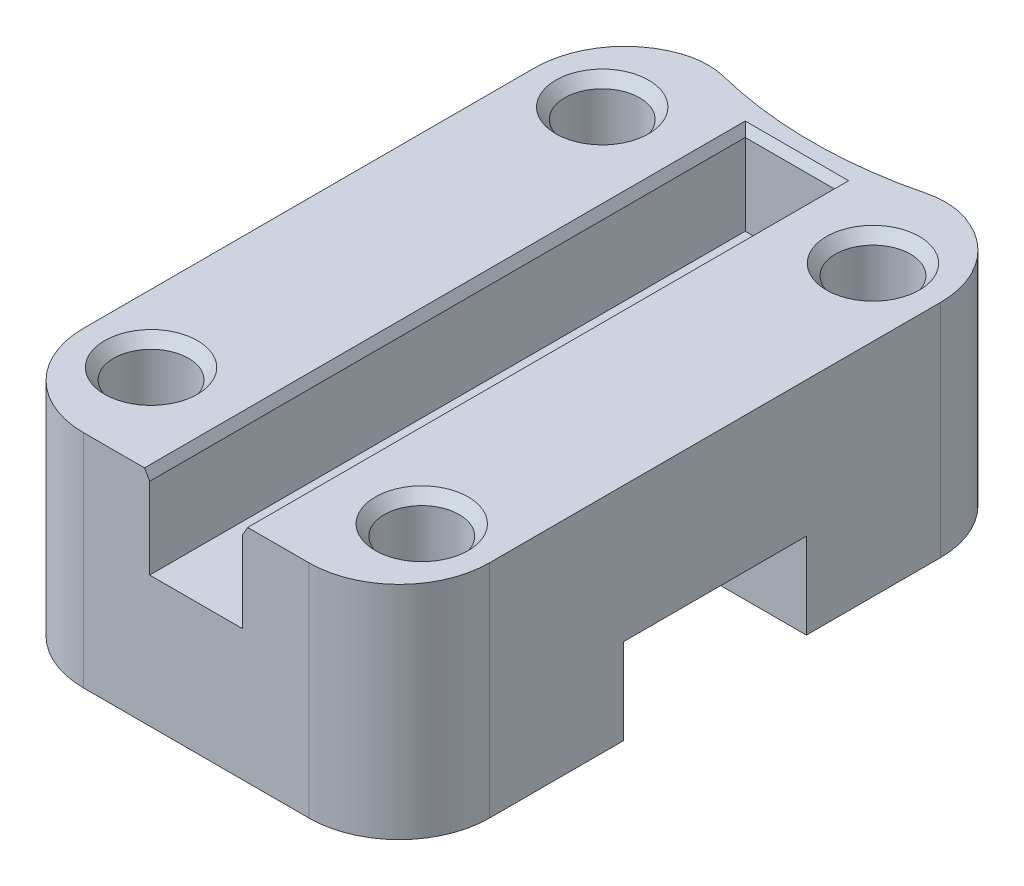
ISO-10303-21;
HEADER;
FILE_DESCRIPTION(('STEP AP214'),'2;1');
FILE_NAME('part.step','',(''),(''),'','','');
FILE_SCHEMA(('AUTOMOTIVE_DESIGN { 1 0 10303 214 1 1 1 1 }'));
ENDSEC;
DATA;
#1=APPLICATION_CONTEXT('core data for automotive mechanical design processes');
#2=APPLICATION_PROTOCOL_DEFINITION('international standard','automotive_design',2000,#1);
#3=PRODUCT_CONTEXT('',#1,'mechanical');
#4=PRODUCT('Part','Part','',(#3));
#5=PRODUCT_RELATED_PRODUCT_CATEGORY('part','',(#4));
#6=PRODUCT_DEFINITION_FORMATION('','',#4);
#7=PRODUCT_DEFINITION_CONTEXT('part definition',#1,'design');
#8=PRODUCT_DEFINITION('design','',#6,#7);
#9=PRODUCT_DEFINITION_SHAPE('','',#8);
#10=(LENGTH_UNIT() NAMED_UNIT(*) SI_UNIT(.MILLI.,.METRE.));
#11=(NAMED_UNIT(*) PLANE_ANGLE_UNIT() SI_UNIT($,.RADIAN.));
#12=(NAMED_UNIT(*) SI_UNIT($,.STERADIAN.) SOLID_ANGLE_UNIT());
#13=UNCERTAINTY_MEASURE_WITH_UNIT(LENGTH_MEASURE(1.E-05),#10,'distance_accuracy_value','');
#14=(GEOMETRIC_REPRESENTATION_CONTEXT(3) GLOBAL_UNCERTAINTY_ASSIGNED_CONTEXT((#13)) GLOBAL_UNIT_ASSIGNED_CONTEXT((#10,
#11,#12)) REPRESENTATION_CONTEXT('',''));
#15=CARTESIAN_POINT('',(0.,0.,0.));
#16=DIRECTION('',(0.,0.,1.));
#17=DIRECTION('',(1.,0.,0.));
#18=AXIS2_PLACEMENT_3D('',#15,#16,#17);
#19=CARTESIAN_POINT('',(0.,0.,0.));
#20=DIRECTION('',(0.,1.,0.));
#21=DIRECTION('',(0.,0.,1.));
#22=AXIS2_PLACEMENT_3D('',#19,#20,#21);
#23=PLANE('',#22);
#24=CARTESIAN_POINT('',(-15.,0.,25.));
#25=DIRECTION('',(0.,-1.,0.));
#26=DIRECTION('',(0.,0.,-1.));
#27=AXIS2_PLACEMENT_3D('',#24,#25,#26);
#28=CIRCLE('',#27,4.15);
#29=CARTESIAN_POINT('',(-15.,0.,20.85));
#30=VERTEX_POINT('',#29);
#31=EDGE_CURVE('E225',#30,#30,#28,.T.);
#32=ORIENTED_EDGE('',*,*,#31,.F.);
#33=EDGE_LOOP('',(#32));
#34=FACE_BOUND('',#33,.T.);
#35=CARTESIAN_POINT('',(15.,0.,25.));
#36=DIRECTION('',(0.,-1.,0.));
#37=DIRECTION('',(0.,0.,-1.));
#38=AXIS2_PLACEMENT_3D('',#35,#36,#37);
#39=CIRCLE('',#38,4.15);
#40=CARTESIAN_POINT('',(15.,0.,20.85));
#41=VERTEX_POINT('',#40);
#42=EDGE_CURVE('E229',#41,#41,#39,.T.);
#43=ORIENTED_EDGE('',*,*,#42,.F.);
#44=EDGE_LOOP('',(#43));
#45=FACE_BOUND('',#44,.T.);
#46=DIRECTION('',(1.,0.,0.));
#47=VECTOR('',#46,1.);
#48=CARTESIAN_POINT('',(22.5,0.,35.));
#49=LINE('',#48,#47);
#50=CARTESIAN_POINT('',(-12.5,0.,35.));
#51=VERTEX_POINT('',#50);
#52=CARTESIAN_POINT('',(12.5,0.,35.));
#53=VERTEX_POINT('',#52);
#54=EDGE_CURVE('E269',#51,#53,#49,.T.);
#55=ORIENTED_EDGE('',*,*,#54,.F.);
#56=CARTESIAN_POINT('',(-12.5,0.,25.));
#57=DIRECTION('',(0.,1.,0.));
#58=DIRECTION('',(0.,0.,1.));
#59=AXIS2_PLACEMENT_3D('',#56,#57,#58);
#60=CIRCLE('',#59,10.);
#61=CARTESIAN_POINT('',(-22.5,0.,25.));
#62=VERTEX_POINT('',#61);
#63=EDGE_CURVE('E328',#51,#62,#60,.F.);
#64=ORIENTED_EDGE('',*,*,#63,.T.);
#65=DIRECTION('',(0.,0.,1.));
#66=VECTOR('',#65,1.);
#67=CARTESIAN_POINT('',(-22.5,0.,35.));
#68=LINE('',#67,#66);
#69=CARTESIAN_POINT('',(-22.5,0.,10.125));
#70=VERTEX_POINT('',#69);
#71=EDGE_CURVE('E262',#70,#62,#68,.T.);
#72=ORIENTED_EDGE('',*,*,#71,.F.);
#73=DIRECTION('',(1.,0.,0.));
#74=VECTOR('',#73,1.);
#75=CARTESIAN_POINT('',(-22.5,0.,10.125));
#76=LINE('',#75,#74);
#77=CARTESIAN_POINT('',(22.5,0.,10.125));
#78=VERTEX_POINT('',#77);
#79=EDGE_CURVE('E245',#70,#78,#76,.T.);
#80=ORIENTED_EDGE('',*,*,#79,.T.);
#81=DIRECTION('',(0.,0.,-1.));
#82=VECTOR('',#81,1.);
#83=CARTESIAN_POINT('',(22.5,0.,35.));
#84=LINE('',#83,#82);
#85=CARTESIAN_POINT('',(22.5,0.,25.));
#86=VERTEX_POINT('',#85);
#87=EDGE_CURVE('E266',#86,#78,#84,.T.);
#88=ORIENTED_EDGE('',*,*,#87,.F.);
#89=CARTESIAN_POINT('',(12.5,0.,25.));
#90=DIRECTION('',(0.,1.,0.));
#91=DIRECTION('',(0.,0.,1.));
#92=AXIS2_PLACEMENT_3D('',#89,#90,#91);
#93=CIRCLE('',#92,10.);
#94=EDGE_CURVE('E326',#86,#53,#93,.F.);
#95=ORIENTED_EDGE('',*,*,#94,.T.);
#96=EDGE_LOOP('',(#55,#64,#72,#80,#88,#95));
#97=FACE_BOUND('',#96,.T.);
#98=ADVANCED_FACE('F35',(#34,#45,#97),#23,.F.);
#99=CARTESIAN_POINT('',(-22.5,14.5,35.));
#100=DIRECTION('',(1.,0.,0.));
#101=DIRECTION('',(0.,0.,-1.));
#102=AXIS2_PLACEMENT_3D('',#99,#100,#101);
#103=PLANE('',#102);
#104=ORIENTED_EDGE('',*,*,#71,.T.);
#105=DIRECTION('',(0.,-1.,0.));
#106=VECTOR('',#105,1.);
#107=CARTESIAN_POINT('',(-22.5,14.5,25.));
#108=LINE('',#107,#106);
#109=CARTESIAN_POINT('',(-22.5,24.5,25.));
#110=VERTEX_POINT('',#109);
#111=EDGE_CURVE('E333',#62,#110,#108,.F.);
#112=ORIENTED_EDGE('',*,*,#111,.T.);
#113=DIRECTION('',(0.,0.,1.));
#114=VECTOR('',#113,1.);
#115=CARTESIAN_POINT('',(-22.5,24.5,35.));
#116=LINE('',#115,#114);
#117=CARTESIAN_POINT('',(-22.5,24.5,-25.));
#118=VERTEX_POINT('',#117);
#119=EDGE_CURVE('E217',#118,#110,#116,.T.);
#120=ORIENTED_EDGE('',*,*,#119,.F.);
#121=DIRECTION('',(0.,-1.,0.));
#122=VECTOR('',#121,1.);
#123=CARTESIAN_POINT('',(-22.5,14.5,-25.));
#124=LINE('',#123,#122);
#125=CARTESIAN_POINT('',(-22.5,0.,-25.));
#126=VERTEX_POINT('',#125);
#127=EDGE_CURVE('E330',#118,#126,#124,.T.);
#128=ORIENTED_EDGE('',*,*,#127,.T.);
#129=CARTESIAN_POINT('',(-22.5,0.,-10.125));
#130=VERTEX_POINT('',#129);
#131=EDGE_CURVE('E267',#126,#130,#68,.T.);
#132=ORIENTED_EDGE('',*,*,#131,.T.);
#133=DIRECTION('',(0.,1.,0.));
#134=VECTOR('',#133,1.);
#135=CARTESIAN_POINT('',(-22.5,9.50000000000001,-10.125));
#136=LINE('',#135,#134);
#137=CARTESIAN_POINT('',(-22.5,9.50000000000001,-10.125));
#138=VERTEX_POINT('',#137);
#139=EDGE_CURVE('E239',#130,#138,#136,.T.);
#140=ORIENTED_EDGE('',*,*,#139,.T.);
#141=DIRECTION('',(0.,0.,1.));
#142=VECTOR('',#141,1.);
#143=CARTESIAN_POINT('',(-22.5,9.50000000000001,-10.125));
#144=LINE('',#143,#142);
#145=CARTESIAN_POINT('',(-22.5,9.5,10.125));
#146=VERTEX_POINT('',#145);
#147=EDGE_CURVE('E242',#138,#146,#144,.T.);
#148=ORIENTED_EDGE('',*,*,#147,.T.);
#149=DIRECTION('',(0.,-1.,0.));
#150=VECTOR('',#149,1.);
#151=CARTESIAN_POINT('',(-22.5,9.5,10.125));
#152=LINE('',#151,#150);
#153=EDGE_CURVE('E236',#146,#70,#152,.T.);
#154=ORIENTED_EDGE('',*,*,#153,.T.);
#155=EDGE_LOOP('',(#104,#112,#120,#128,#132,#140,#148,#154));
#156=FACE_BOUND('',#155,.T.);
#157=ADVANCED_FACE('F387',(#156),#103,.F.);
#158=CARTESIAN_POINT('',(22.5,14.5,35.));
#159=DIRECTION('',(0.,0.,-1.));
#160=DIRECTION('',(-1.,0.,0.));
#161=AXIS2_PLACEMENT_3D('',#158,#159,#160);
#162=PLANE('',#161);
#163=DIRECTION('',(1.,0.,0.));
#164=VECTOR('',#163,1.);
#165=CARTESIAN_POINT('',(-5.15,24.5,35.));
#166=LINE('',#165,#164);
#167=CARTESIAN_POINT('',(-12.5,24.5,35.));
#168=VERTEX_POINT('',#167);
#169=CARTESIAN_POINT('',(-5.72735026918963,24.5,35.));
#170=VERTEX_POINT('',#169);
#171=EDGE_CURVE('E418',#168,#170,#166,.T.);
#172=ORIENTED_EDGE('',*,*,#171,.F.);
#173=DIRECTION('',(0.,-1.,0.));
#174=VECTOR('',#173,1.);
#175=CARTESIAN_POINT('',(-12.5,14.5,35.));
#176=LINE('',#175,#174);
#177=EDGE_CURVE('E323',#168,#51,#176,.T.);
#178=ORIENTED_EDGE('',*,*,#177,.T.);
#179=ORIENTED_EDGE('',*,*,#54,.T.);
#180=DIRECTION('',(0.,-1.,0.));
#181=VECTOR('',#180,1.);
#182=CARTESIAN_POINT('',(12.5,14.5,35.));
#183=LINE('',#182,#181);
#184=CARTESIAN_POINT('',(12.5,24.5,35.));
#185=VERTEX_POINT('',#184);
#186=EDGE_CURVE('E319',#53,#185,#183,.F.);
#187=ORIENTED_EDGE('',*,*,#186,.T.);
#188=DIRECTION('',(1.,0.,0.));
#189=VECTOR('',#188,1.);
#190=CARTESIAN_POINT('',(5.15,24.5,35.));
#191=LINE('',#190,#189);
#192=CARTESIAN_POINT('',(5.70756444527081,24.5,35.));
#193=VERTEX_POINT('',#192);
#194=EDGE_CURVE('E421',#193,#185,#191,.T.);
#195=ORIENTED_EDGE('',*,*,#194,.F.);
#196=DIRECTION('',(-0.500000016850885,-0.866025394055576,0.));
#197=VECTOR('',#196,1.);
#198=CARTESIAN_POINT('',(5.71018744100996,24.5045431616841,35.));
#199=LINE('',#198,#197);
#200=CARTESIAN_POINT('',(5.15,23.5342700956927,35.));
#201=VERTEX_POINT('',#200);
#202=EDGE_CURVE('E309',#193,#201,#199,.T.);
#203=ORIENTED_EDGE('',*,*,#202,.T.);
#204=DIRECTION('',(0.,-1.,0.));
#205=VECTOR('',#204,1.);
#206=CARTESIAN_POINT('',(5.15,24.5,35.));
#207=LINE('',#206,#205);
#208=CARTESIAN_POINT('',(5.15,14.5,35.));
#209=VERTEX_POINT('',#208);
#210=EDGE_CURVE('E218',#201,#209,#207,.T.);
#211=ORIENTED_EDGE('',*,*,#210,.T.);
#212=DIRECTION('',(1.,0.,0.));
#213=VECTOR('',#212,1.);
#214=CARTESIAN_POINT('',(22.5,14.5,35.));
#215=LINE('',#214,#213);
#216=CARTESIAN_POINT('',(-5.15,14.5,35.));
#217=VERTEX_POINT('',#216);
#218=EDGE_CURVE('E263',#217,#209,#215,.T.);
#219=ORIENTED_EDGE('',*,*,#218,.F.);
#220=DIRECTION('',(0.,-1.,0.));
#221=VECTOR('',#220,1.);
#222=CARTESIAN_POINT('',(-5.15,24.5,35.));
#223=LINE('',#222,#221);
#224=CARTESIAN_POINT('',(-5.15,23.5,35.));
#225=VERTEX_POINT('',#224);
#226=EDGE_CURVE('E188',#225,#217,#223,.T.);
#227=ORIENTED_EDGE('',*,*,#226,.F.);
#228=DIRECTION('',(-0.499999999999997,0.86602540378444,0.));
#229=VECTOR('',#228,1.);
#230=CARTESIAN_POINT('',(-5.72735026918963,24.5,35.));
#231=LINE('',#230,#229);
#232=EDGE_CURVE('E311',#225,#170,#231,.T.);
#233=ORIENTED_EDGE('',*,*,#232,.T.);
#234=EDGE_LOOP('',(#172,#178,#179,#187,#195,#203,#211,#219,#227,#233));
#235=FACE_BOUND('',#234,.T.);
#236=ADVANCED_FACE('F416',(#235),#162,.F.);
#237=CARTESIAN_POINT('',(22.5,14.5,35.));
#238=DIRECTION('',(-1.,0.,0.));
#239=DIRECTION('',(0.,0.,1.));
#240=AXIS2_PLACEMENT_3D('',#237,#238,#239);
#241=PLANE('',#240);
#242=DIRECTION('',(0.,0.,-1.));
#243=VECTOR('',#242,1.);
#244=CARTESIAN_POINT('',(22.5,24.5,35.));
#245=LINE('',#244,#243);
#246=CARTESIAN_POINT('',(22.5,24.5,25.));
#247=VERTEX_POINT('',#246);
#248=CARTESIAN_POINT('',(22.5,24.5,-25.));
#249=VERTEX_POINT('',#248);
#250=EDGE_CURVE('E210',#247,#249,#245,.T.);
#251=ORIENTED_EDGE('',*,*,#250,.F.);
#252=DIRECTION('',(0.,-1.,0.));
#253=VECTOR('',#252,1.);
#254=CARTESIAN_POINT('',(22.5,14.5,25.));
#255=LINE('',#254,#253);
#256=EDGE_CURVE('E346',#247,#86,#255,.T.);
#257=ORIENTED_EDGE('',*,*,#256,.T.);
#258=ORIENTED_EDGE('',*,*,#87,.T.);
#259=DIRECTION('',(0.,1.,0.));
#260=VECTOR('',#259,1.);
#261=CARTESIAN_POINT('',(22.5,14.5,10.125));
#262=LINE('',#261,#260);
#263=CARTESIAN_POINT('',(22.5,9.5,10.125));
#264=VERTEX_POINT('',#263);
#265=EDGE_CURVE('E259',#78,#264,#262,.T.);
#266=ORIENTED_EDGE('',*,*,#265,.T.);
#267=DIRECTION('',(0.,0.,-1.));
#268=VECTOR('',#267,1.);
#269=CARTESIAN_POINT('',(22.5,9.5,35.));
#270=LINE('',#269,#268);
#271=CARTESIAN_POINT('',(22.5,9.50000000000001,-10.125));
#272=VERTEX_POINT('',#271);
#273=EDGE_CURVE('E265',#264,#272,#270,.T.);
#274=ORIENTED_EDGE('',*,*,#273,.T.);
#275=DIRECTION('',(0.,-1.,0.));
#276=VECTOR('',#275,1.);
#277=CARTESIAN_POINT('',(22.5,14.5,-10.125));
#278=LINE('',#277,#276);
#279=CARTESIAN_POINT('',(22.5,0.,-10.125));
#280=VERTEX_POINT('',#279);
#281=EDGE_CURVE('E249',#272,#280,#278,.T.);
#282=ORIENTED_EDGE('',*,*,#281,.T.);
#283=CARTESIAN_POINT('',(22.5,0.,-25.));
#284=VERTEX_POINT('',#283);
#285=EDGE_CURVE('E272',#280,#284,#84,.T.);
#286=ORIENTED_EDGE('',*,*,#285,.T.);
#287=DIRECTION('',(0.,-1.,0.));
#288=VECTOR('',#287,1.);
#289=CARTESIAN_POINT('',(22.5,14.5,-25.));
#290=LINE('',#289,#288);
#291=EDGE_CURVE('E344',#284,#249,#290,.F.);
#292=ORIENTED_EDGE('',*,*,#291,.T.);
#293=EDGE_LOOP('',(#251,#257,#258,#266,#274,#282,#286,#292));
#294=FACE_BOUND('',#293,.T.);
#295=ADVANCED_FACE('F396',(#294),#241,.F.);
#296=CARTESIAN_POINT('',(0.,14.5,0.));
#297=DIRECTION('',(0.,1.,0.));
#298=DIRECTION('',(0.,0.,1.));
#299=AXIS2_PLACEMENT_3D('',#296,#297,#298);
#300=PLANE('',#299);
#301=DIRECTION('',(0.363344208928321,0.,0.93165497145577));
#302=VECTOR('',#301,1.);
#303=CARTESIAN_POINT('',(5.15,14.5,35.));
#304=LINE('',#303,#302);
#305=CARTESIAN_POINT('',(5.13022934751461,14.5,34.9493058476664));
#306=VERTEX_POINT('',#305);
#307=EDGE_CURVE('E214',#306,#209,#304,.T.);
#308=ORIENTED_EDGE('',*,*,#307,.F.);
#309=DIRECTION('',(-0.000299785590505607,0.,0.999999955064299));
#310=VECTOR('',#309,1.);
#311=CARTESIAN_POINT('',(5.15,14.5,-31.));
#312=LINE('',#311,#310);
#313=CARTESIAN_POINT('',(5.15,14.5,-31.));
#314=VERTEX_POINT('',#313);
#315=EDGE_CURVE('E200',#314,#306,#312,.T.);
#316=ORIENTED_EDGE('',*,*,#315,.F.);
#317=DIRECTION('',(1.,0.,0.));
#318=VECTOR('',#317,1.);
#319=CARTESIAN_POINT('',(-5.15,14.5,-31.));
#320=LINE('',#319,#318);
#321=CARTESIAN_POINT('',(-5.15,14.5,-31.));
#322=VERTEX_POINT('',#321);
#323=EDGE_CURVE('E182',#322,#314,#320,.T.);
#324=ORIENTED_EDGE('',*,*,#323,.F.);
#325=DIRECTION('',(0.,0.,-1.));
#326=VECTOR('',#325,1.);
#327=CARTESIAN_POINT('',(-5.15,14.5,35.));
#328=LINE('',#327,#326);
#329=EDGE_CURVE('E197',#217,#322,#328,.T.);
#330=ORIENTED_EDGE('',*,*,#329,.F.);
#331=ORIENTED_EDGE('',*,*,#218,.T.);
#332=EDGE_LOOP('',(#308,#316,#324,#330,#331));
#333=FACE_BOUND('',#332,.T.);
#334=ADVANCED_FACE('F195',(#333),#300,.T.);
#335=CARTESIAN_POINT('',(15.,0.,-25.));
#336=DIRECTION('',(0.,-1.,0.));
#337=DIRECTION('',(0.,0.,-1.));
#338=AXIS2_PLACEMENT_3D('',#335,#336,#337);
#339=CIRCLE('',#338,4.15);
#340=CARTESIAN_POINT('',(15.,0.,-29.15));
#341=VERTEX_POINT('',#340);
#342=EDGE_CURVE('E224',#341,#341,#339,.T.);
#343=ORIENTED_EDGE('',*,*,#342,.F.);
#344=EDGE_LOOP('',(#343));
#345=FACE_BOUND('',#344,.T.);
#346=CARTESIAN_POINT('',(-15.,0.,-25.));
#347=DIRECTION('',(0.,-1.,0.));
#348=DIRECTION('',(0.,0.,-1.));
#349=AXIS2_PLACEMENT_3D('',#346,#347,#348);
#350=CIRCLE('',#349,4.15);
#351=CARTESIAN_POINT('',(-15.,0.,-29.15));
#352=VERTEX_POINT('',#351);
#353=EDGE_CURVE('E228',#352,#352,#350,.T.);
#354=ORIENTED_EDGE('',*,*,#353,.F.);
#355=EDGE_LOOP('',(#354));
#356=FACE_BOUND('',#355,.T.);
#357=CARTESIAN_POINT('',(-12.5,0.,-25.));
#358=DIRECTION('',(0.,1.,0.));
#359=DIRECTION('',(0.,0.,1.));
#360=AXIS2_PLACEMENT_3D('',#357,#358,#359);
#361=CIRCLE('',#360,10.);
#362=CARTESIAN_POINT('',(-15.7226987115136,0.,-34.46647838506));
#363=VERTEX_POINT('',#362);
#364=EDGE_CURVE('E351',#126,#363,#361,.F.);
#365=ORIENTED_EDGE('',*,*,#364,.T.);
#366=CARTESIAN_POINT('',(-13.1445397423027,0.,-26.893295677012));
#367=DIRECTION('',(0.,1.,0.));
#368=DIRECTION('',(0.,0.,1.));
#369=AXIS2_PLACEMENT_3D('',#366,#367,#368);
#370=CIRCLE('',#369,8.);
#371=CARTESIAN_POINT('',(-11.1972005212208,0.,-34.6526687159911));
#372=VERTEX_POINT('',#371);
#373=EDGE_CURVE('E43',#363,#372,#370,.F.);
#374=ORIENTED_EDGE('',*,*,#373,.T.);
#375=CARTESIAN_POINT('',(0.,0.,-79.2690636901211));
#376=DIRECTION('',(0.,-1.,0.));
#377=DIRECTION('',(0.,0.,-1.));
#378=AXIS2_PLACEMENT_3D('',#375,#376,#377);
#379=CIRCLE('',#378,46.);
#380=CARTESIAN_POINT('',(11.1972005212209,0.,-34.6526687159911));
#381=VERTEX_POINT('',#380);
#382=EDGE_CURVE('E367',#381,#372,#379,.T.);
#383=ORIENTED_EDGE('',*,*,#382,.F.);
#384=CARTESIAN_POINT('',(13.1445397423027,0.,-26.893295677012));
#385=DIRECTION('',(0.,1.,0.));
#386=DIRECTION('',(0.,0.,1.));
#387=AXIS2_PLACEMENT_3D('',#384,#385,#386);
#388=CIRCLE('',#387,8.);
#389=CARTESIAN_POINT('',(15.7226987115136,0.,-34.46647838506));
#390=VERTEX_POINT('',#389);
#391=EDGE_CURVE('E50',#381,#390,#388,.F.);
#392=ORIENTED_EDGE('',*,*,#391,.T.);
#393=CARTESIAN_POINT('',(12.5,0.,-25.));
#394=DIRECTION('',(0.,1.,0.));
#395=DIRECTION('',(0.,0.,1.));
#396=AXIS2_PLACEMENT_3D('',#393,#394,#395);
#397=CIRCLE('',#396,10.);
#398=EDGE_CURVE('E349',#390,#284,#397,.F.);
#399=ORIENTED_EDGE('',*,*,#398,.T.);
#400=ORIENTED_EDGE('',*,*,#285,.F.);
#401=DIRECTION('',(1.,0.,0.));
#402=VECTOR('',#401,1.);
#403=CARTESIAN_POINT('',(-22.5,0.,-10.125));
#404=LINE('',#403,#402);
#405=EDGE_CURVE('E253',#130,#280,#404,.T.);
#406=ORIENTED_EDGE('',*,*,#405,.F.);
#407=ORIENTED_EDGE('',*,*,#131,.F.);
#408=EDGE_LOOP('',(#365,#374,#383,#392,#399,#400,#406,#407));
#409=FACE_BOUND('',#408,.T.);
#410=ADVANCED_FACE('F366',(#345,#356,#409),#23,.F.);
#411=CARTESIAN_POINT('',(-22.5,9.50000000000001,-10.125));
#412=DIRECTION('',(0.,1.,0.));
#413=DIRECTION('',(0.,0.,1.));
#414=AXIS2_PLACEMENT_3D('',#411,#412,#413);
#415=PLANE('',#414);
#416=DIRECTION('',(1.,0.,0.));
#417=VECTOR('',#416,1.);
#418=CARTESIAN_POINT('',(-22.5,9.5,10.125));
#419=LINE('',#418,#417);
#420=EDGE_CURVE('E246',#146,#264,#419,.T.);
#421=ORIENTED_EDGE('',*,*,#420,.F.);
#422=ORIENTED_EDGE('',*,*,#147,.F.);
#423=DIRECTION('',(1.,0.,0.));
#424=VECTOR('',#423,1.);
#425=CARTESIAN_POINT('',(-22.5,9.50000000000001,-10.125));
#426=LINE('',#425,#424);
#427=EDGE_CURVE('E250',#138,#272,#426,.T.);
#428=ORIENTED_EDGE('',*,*,#427,.T.);
#429=ORIENTED_EDGE('',*,*,#273,.F.);
#430=EDGE_LOOP('',(#421,#422,#428,#429));
#431=FACE_BOUND('',#430,.T.);
#432=ADVANCED_FACE('F400',(#431),#415,.F.);
#433=CARTESIAN_POINT('',(-22.5,9.5,10.125));
#434=DIRECTION('',(0.,0.,1.));
#435=DIRECTION('',(0.,-1.,0.));
#436=AXIS2_PLACEMENT_3D('',#433,#434,#435);
#437=PLANE('',#436);
#438=ORIENTED_EDGE('',*,*,#79,.F.);
#439=ORIENTED_EDGE('',*,*,#153,.F.);
#440=ORIENTED_EDGE('',*,*,#420,.T.);
#441=ORIENTED_EDGE('',*,*,#265,.F.);
#442=EDGE_LOOP('',(#438,#439,#440,#441));
#443=FACE_BOUND('',#442,.T.);
#444=ADVANCED_FACE('F404',(#443),#437,.F.);
#445=CARTESIAN_POINT('',(-22.5,9.50000000000001,-10.125));
#446=DIRECTION('',(0.,0.,-1.));
#447=DIRECTION('',(0.,1.,0.));
#448=AXIS2_PLACEMENT_3D('',#445,#446,#447);
#449=PLANE('',#448);
#450=ORIENTED_EDGE('',*,*,#427,.F.);
#451=ORIENTED_EDGE('',*,*,#139,.F.);
#452=ORIENTED_EDGE('',*,*,#405,.T.);
#453=ORIENTED_EDGE('',*,*,#281,.F.);
#454=EDGE_LOOP('',(#450,#451,#452,#453));
#455=FACE_BOUND('',#454,.T.);
#456=ADVANCED_FACE('F393',(#455),#449,.F.);
#457=CARTESIAN_POINT('',(-15.,14.5,-25.));
#458=DIRECTION('',(0.,-1.,0.));
#459=DIRECTION('',(0.,0.,-1.));
#460=AXIS2_PLACEMENT_3D('',#457,#458,#459);
#461=CYLINDRICAL_SURFACE('',#460,4.15);
#462=CARTESIAN_POINT('',(-15.,23.3082464074057,-25.));
#463=DIRECTION('',(0.,1.,0.));
#464=DIRECTION('',(0.,0.,1.));
#465=AXIS2_PLACEMENT_3D('',#462,#463,#464);
#466=CIRCLE('',#465,4.15);
#467=CARTESIAN_POINT('',(-15.,23.3082464074057,-20.85));
#468=VERTEX_POINT('',#467);
#469=EDGE_CURVE('E294',#468,#468,#466,.T.);
#470=ORIENTED_EDGE('',*,*,#469,.T.);
#471=EDGE_LOOP('',(#470));
#472=FACE_BOUND('',#471,.T.);
#473=ORIENTED_EDGE('',*,*,#353,.T.);
#474=EDGE_LOOP('',(#473));
#475=FACE_BOUND('',#474,.T.);
#476=ADVANCED_FACE('F462',(#472,#475),#461,.F.);
#477=CARTESIAN_POINT('',(15.,14.5,-25.));
#478=DIRECTION('',(0.,-1.,0.));
#479=DIRECTION('',(0.,0.,-1.));
#480=AXIS2_PLACEMENT_3D('',#477,#478,#479);
#481=CYLINDRICAL_SURFACE('',#480,4.15);
#482=CARTESIAN_POINT('',(15.,23.3082464074057,-25.));
#483=DIRECTION('',(0.,1.,0.));
#484=DIRECTION('',(0.,0.,1.));
#485=AXIS2_PLACEMENT_3D('',#482,#483,#484);
#486=CIRCLE('',#485,4.15);
#487=CARTESIAN_POINT('',(15.,23.3082464074057,-20.85));
#488=VERTEX_POINT('',#487);
#489=EDGE_CURVE('E297',#488,#488,#486,.T.);
#490=ORIENTED_EDGE('',*,*,#489,.T.);
#491=EDGE_LOOP('',(#490));
#492=FACE_BOUND('',#491,.T.);
#493=ORIENTED_EDGE('',*,*,#342,.T.);
#494=EDGE_LOOP('',(#493));
#495=FACE_BOUND('',#494,.T.);
#496=ADVANCED_FACE('F464',(#492,#495),#481,.F.);
#497=CARTESIAN_POINT('',(15.,14.5,25.));
#498=DIRECTION('',(0.,-1.,0.));
#499=DIRECTION('',(0.,0.,-1.));
#500=AXIS2_PLACEMENT_3D('',#497,#498,#499);
#501=CYLINDRICAL_SURFACE('',#500,4.15);
#502=CARTESIAN_POINT('',(15.,23.3082464074057,25.));
#503=DIRECTION('',(0.,1.,0.));
#504=DIRECTION('',(0.,0.,1.));
#505=AXIS2_PLACEMENT_3D('',#502,#503,#504);
#506=CIRCLE('',#505,4.15);
#507=CARTESIAN_POINT('',(15.,23.3082464074057,29.15));
#508=VERTEX_POINT('',#507);
#509=EDGE_CURVE('E276',#508,#508,#506,.T.);
#510=ORIENTED_EDGE('',*,*,#509,.T.);
#511=EDGE_LOOP('',(#510));
#512=FACE_BOUND('',#511,.T.);
#513=ORIENTED_EDGE('',*,*,#42,.T.);
#514=EDGE_LOOP('',(#513));
#515=FACE_BOUND('',#514,.T.);
#516=ADVANCED_FACE('F471',(#512,#515),#501,.F.);
#517=CARTESIAN_POINT('',(-15.,14.5,25.));
#518=DIRECTION('',(0.,-1.,0.));
#519=DIRECTION('',(0.,0.,-1.));
#520=AXIS2_PLACEMENT_3D('',#517,#518,#519);
#521=CYLINDRICAL_SURFACE('',#520,4.15);
#522=CARTESIAN_POINT('',(-15.,23.3082464074057,25.));
#523=DIRECTION('',(0.,1.,0.));
#524=DIRECTION('',(0.,0.,1.));
#525=AXIS2_PLACEMENT_3D('',#522,#523,#524);
#526=CIRCLE('',#525,4.15);
#527=CARTESIAN_POINT('',(-15.,23.3082464074057,29.15));
#528=VERTEX_POINT('',#527);
#529=EDGE_CURVE('E291',#528,#528,#526,.T.);
#530=ORIENTED_EDGE('',*,*,#529,.T.);
#531=EDGE_LOOP('',(#530));
#532=FACE_BOUND('',#531,.T.);
#533=ORIENTED_EDGE('',*,*,#31,.T.);
#534=EDGE_LOOP('',(#533));
#535=FACE_BOUND('',#534,.T.);
#536=ADVANCED_FACE('F517',(#532,#535),#521,.F.);
#537=CARTESIAN_POINT('',(0.,24.5,0.));
#538=DIRECTION('',(0.,1.,0.));
#539=DIRECTION('',(0.,0.,1.));
#540=AXIS2_PLACEMENT_3D('',#537,#538,#539);
#541=PLANE('',#540);
#542=CARTESIAN_POINT('',(0.,24.5,-79.2690636901211));
#543=DIRECTION('',(0.,-1.,0.));
#544=DIRECTION('',(0.,0.,-1.));
#545=AXIS2_PLACEMENT_3D('',#542,#543,#544);
#546=CIRCLE('',#545,46.);
#547=CARTESIAN_POINT('',(11.1972005212209,24.5,-34.6526687159911));
#548=VERTEX_POINT('',#547);
#549=CARTESIAN_POINT('',(-11.1972005212208,24.5,-34.6526687159911));
#550=VERTEX_POINT('',#549);
#551=EDGE_CURVE('E320',#548,#550,#546,.T.);
#552=ORIENTED_EDGE('',*,*,#551,.T.);
#553=CARTESIAN_POINT('',(-13.1445397423027,24.5,-26.893295677012));
#554=DIRECTION('',(0.,1.,0.));
#555=DIRECTION('',(0.,0.,1.));
#556=AXIS2_PLACEMENT_3D('',#553,#554,#555);
#557=CIRCLE('',#556,8.);
#558=CARTESIAN_POINT('',(-15.7226987115136,24.5,-34.46647838506));
#559=VERTEX_POINT('',#558);
#560=EDGE_CURVE('E361',#550,#559,#557,.T.);
#561=ORIENTED_EDGE('',*,*,#560,.T.);
#562=CARTESIAN_POINT('',(-12.5,24.5,-25.));
#563=DIRECTION('',(0.,1.,0.));
#564=DIRECTION('',(0.,0.,1.));
#565=AXIS2_PLACEMENT_3D('',#562,#563,#564);
#566=CIRCLE('',#565,10.);
#567=EDGE_CURVE('E338',#559,#118,#566,.T.);
#568=ORIENTED_EDGE('',*,*,#567,.T.);
#569=ORIENTED_EDGE('',*,*,#119,.T.);
#570=CARTESIAN_POINT('',(-12.5,24.5,25.));
#571=DIRECTION('',(0.,1.,0.));
#572=DIRECTION('',(0.,0.,1.));
#573=AXIS2_PLACEMENT_3D('',#570,#571,#572);
#574=CIRCLE('',#573,10.);
#575=EDGE_CURVE('E342',#110,#168,#574,.T.);
#576=ORIENTED_EDGE('',*,*,#575,.T.);
#577=ORIENTED_EDGE('',*,*,#171,.T.);
#578=DIRECTION('',(0.,0.,-1.));
#579=VECTOR('',#578,1.);
#580=CARTESIAN_POINT('',(-5.72735026918963,24.5,-31.));
#581=LINE('',#580,#579);
#582=CARTESIAN_POINT('',(-5.72735026918963,24.5,-31.5773502691896));
#583=VERTEX_POINT('',#582);
#584=EDGE_CURVE('E304',#170,#583,#581,.T.);
#585=ORIENTED_EDGE('',*,*,#584,.T.);
#586=DIRECTION('',(1.,0.,0.));
#587=VECTOR('',#586,1.);
#588=CARTESIAN_POINT('',(5.15,24.5,-31.5773502691896));
#589=LINE('',#588,#587);
#590=CARTESIAN_POINT('',(5.72752337643242,24.5,-31.5773502691896));
#591=VERTEX_POINT('',#590);
#592=EDGE_CURVE('E302',#583,#591,#589,.T.);
#593=ORIENTED_EDGE('',*,*,#592,.T.);
#594=DIRECTION('',(-0.000299785590505607,0.,0.999999955064299));
#595=VECTOR('',#594,1.);
#596=CARTESIAN_POINT('',(5.7075795907606,24.5,34.9494789289578));
#597=LINE('',#596,#595);
#598=EDGE_CURVE('E300',#591,#193,#597,.T.);
#599=ORIENTED_EDGE('',*,*,#598,.T.);
#600=ORIENTED_EDGE('',*,*,#194,.T.);
#601=CARTESIAN_POINT('',(12.5,24.5,25.));
#602=DIRECTION('',(0.,1.,0.));
#603=DIRECTION('',(0.,0.,1.));
#604=AXIS2_PLACEMENT_3D('',#601,#602,#603);
#605=CIRCLE('',#604,10.);
#606=EDGE_CURVE('E340',#185,#247,#605,.T.);
#607=ORIENTED_EDGE('',*,*,#606,.T.);
#608=ORIENTED_EDGE('',*,*,#250,.T.);
#609=CARTESIAN_POINT('',(12.5,24.5,-25.));
#610=DIRECTION('',(0.,1.,0.));
#611=DIRECTION('',(0.,0.,1.));
#612=AXIS2_PLACEMENT_3D('',#609,#610,#611);
#613=CIRCLE('',#612,10.);
#614=CARTESIAN_POINT('',(15.7226987115136,24.5,-34.46647838506));
#615=VERTEX_POINT('',#614);
#616=EDGE_CURVE('E335',#249,#615,#613,.T.);
#617=ORIENTED_EDGE('',*,*,#616,.T.);
#618=CARTESIAN_POINT('',(13.1445397423027,24.5,-26.893295677012));
#619=DIRECTION('',(0.,1.,0.));
#620=DIRECTION('',(0.,0.,1.));
#621=AXIS2_PLACEMENT_3D('',#618,#619,#620);
#622=CIRCLE('',#621,8.);
#623=EDGE_CURVE('E359',#615,#548,#622,.T.);
#624=ORIENTED_EDGE('',*,*,#623,.T.);
#625=EDGE_LOOP('',(#552,#561,#568,#569,#576,#577,#585,#593,#599,#600,#607,#608,#617,#624));
#626=FACE_BOUND('',#625,.T.);
#627=CARTESIAN_POINT('',(15.,24.5,25.));
#628=DIRECTION('',(0.,1.,0.));
#629=DIRECTION('',(0.,0.,1.));
#630=AXIS2_PLACEMENT_3D('',#627,#628,#629);
#631=CIRCLE('',#630,5.15000000000004);
#632=CARTESIAN_POINT('',(15.,24.5,30.1500000000001));
#633=VERTEX_POINT('',#632);
#634=EDGE_CURVE('E288',#633,#633,#631,.F.);
#635=ORIENTED_EDGE('',*,*,#634,.T.);
#636=EDGE_LOOP('',(#635));
#637=FACE_BOUND('',#636,.T.);
#638=CARTESIAN_POINT('',(-15.,24.5,25.));
#639=DIRECTION('',(0.,1.,0.));
#640=DIRECTION('',(0.,0.,1.));
#641=AXIS2_PLACEMENT_3D('',#638,#639,#640);
#642=CIRCLE('',#641,5.15000000000004);
#643=CARTESIAN_POINT('',(-15.,24.5,30.1500000000001));
#644=VERTEX_POINT('',#643);
#645=EDGE_CURVE('E285',#644,#644,#642,.F.);
#646=ORIENTED_EDGE('',*,*,#645,.T.);
#647=EDGE_LOOP('',(#646));
#648=FACE_BOUND('',#647,.T.);
#649=CARTESIAN_POINT('',(-15.,24.5,-25.));
#650=DIRECTION('',(0.,1.,0.));
#651=DIRECTION('',(0.,0.,1.));
#652=AXIS2_PLACEMENT_3D('',#649,#650,#651);
#653=CIRCLE('',#652,5.15000000000004);
#654=CARTESIAN_POINT('',(-15.,24.5,-19.85));
#655=VERTEX_POINT('',#654);
#656=EDGE_CURVE('E282',#655,#655,#653,.F.);
#657=ORIENTED_EDGE('',*,*,#656,.T.);
#658=EDGE_LOOP('',(#657));
#659=FACE_BOUND('',#658,.T.);
#660=CARTESIAN_POINT('',(15.,24.5,-25.));
#661=DIRECTION('',(0.,1.,0.));
#662=DIRECTION('',(0.,0.,1.));
#663=AXIS2_PLACEMENT_3D('',#660,#661,#662);
#664=CIRCLE('',#663,5.15000000000004);
#665=CARTESIAN_POINT('',(15.,24.5,-19.85));
#666=VERTEX_POINT('',#665);
#667=EDGE_CURVE('E279',#666,#666,#664,.F.);
#668=ORIENTED_EDGE('',*,*,#667,.T.);
#669=EDGE_LOOP('',(#668));
#670=FACE_BOUND('',#669,.T.);
#671=ADVANCED_FACE('F379',(#626,#637,#648,#659,#670),#541,.T.);
#672=CARTESIAN_POINT('',(-5.15,24.5,35.));
#673=DIRECTION('',(-1.,0.,0.));
#674=DIRECTION('',(0.,0.,1.));
#675=AXIS2_PLACEMENT_3D('',#672,#673,#674);
#676=PLANE('',#675);
#677=DIRECTION('',(0.,-1.,0.));
#678=VECTOR('',#677,1.);
#679=CARTESIAN_POINT('',(-5.15,24.5,-31.));
#680=LINE('',#679,#678);
#681=CARTESIAN_POINT('',(-5.15,23.5,-31.));
#682=VERTEX_POINT('',#681);
#683=EDGE_CURVE('E178',#682,#322,#680,.T.);
#684=ORIENTED_EDGE('',*,*,#683,.F.);
#685=DIRECTION('',(0.,0.,1.));
#686=VECTOR('',#685,1.);
#687=CARTESIAN_POINT('',(-5.15,23.5,35.));
#688=LINE('',#687,#686);
#689=EDGE_CURVE('E307',#682,#225,#688,.T.);
#690=ORIENTED_EDGE('',*,*,#689,.T.);
#691=ORIENTED_EDGE('',*,*,#226,.T.);
#692=ORIENTED_EDGE('',*,*,#329,.T.);
#693=EDGE_LOOP('',(#684,#690,#691,#692));
#694=FACE_BOUND('',#693,.T.);
#695=ADVANCED_FACE('F202',(#694),#676,.F.);
#696=CARTESIAN_POINT('',(-5.15,24.5,-31.));
#697=DIRECTION('',(0.,0.,-1.));
#698=DIRECTION('',(-1.,0.,0.));
#699=AXIS2_PLACEMENT_3D('',#696,#697,#698);
#700=PLANE('',#699);
#701=DIRECTION('',(0.,-1.,0.));
#702=VECTOR('',#701,1.);
#703=CARTESIAN_POINT('',(5.15,24.5,-31.));
#704=LINE('',#703,#702);
#705=CARTESIAN_POINT('',(5.15,23.5,-31.));
#706=VERTEX_POINT('',#705);
#707=EDGE_CURVE('E189',#706,#314,#704,.T.);
#708=ORIENTED_EDGE('',*,*,#707,.F.);
#709=DIRECTION('',(-1.,0.,0.));
#710=VECTOR('',#709,1.);
#711=CARTESIAN_POINT('',(-5.15,23.5,-31.));
#712=LINE('',#711,#710);
#713=EDGE_CURVE('E184',#706,#682,#712,.T.);
#714=ORIENTED_EDGE('',*,*,#713,.T.);
#715=ORIENTED_EDGE('',*,*,#683,.T.);
#716=ORIENTED_EDGE('',*,*,#323,.T.);
#717=EDGE_LOOP('',(#708,#714,#715,#716));
#718=FACE_BOUND('',#717,.T.);
#719=ADVANCED_FACE('F181',(#718),#700,.F.);
#720=CARTESIAN_POINT('',(5.15,24.5,-31.));
#721=DIRECTION('',(0.999999955064299,0.,0.000299785590505607));
#722=DIRECTION('',(0.000299785590505607,0.,-0.999999955064299));
#723=AXIS2_PLACEMENT_3D('',#720,#721,#722);
#724=PLANE('',#723);
#725=DIRECTION('',(0.,-1.,0.));
#726=VECTOR('',#725,1.);
#727=CARTESIAN_POINT('',(5.13022934751461,24.5,34.9493058476664));
#728=LINE('',#727,#726);
#729=CARTESIAN_POINT('',(5.13022934751461,23.5,34.9493058476664));
#730=VERTEX_POINT('',#729);
#731=EDGE_CURVE('E220',#730,#306,#728,.T.);
#732=ORIENTED_EDGE('',*,*,#731,.F.);
#733=DIRECTION('',(0.000299785590505607,0.,-0.999999955064299));
#734=VECTOR('',#733,1.);
#735=CARTESIAN_POINT('',(5.15,23.5,-31.));
#736=LINE('',#735,#734);
#737=EDGE_CURVE('E317',#730,#706,#736,.T.);
#738=ORIENTED_EDGE('',*,*,#737,.T.);
#739=ORIENTED_EDGE('',*,*,#707,.T.);
#740=ORIENTED_EDGE('',*,*,#315,.T.);
#741=EDGE_LOOP('',(#732,#738,#739,#740));
#742=FACE_BOUND('',#741,.T.);
#743=ADVANCED_FACE('F594',(#742),#724,.F.);
#744=CARTESIAN_POINT('',(5.15,24.5,35.));
#745=DIRECTION('',(0.93165497145577,0.,-0.363344208928321));
#746=DIRECTION('',(-0.363344208928321,0.,-0.93165497145577));
#747=AXIS2_PLACEMENT_3D('',#744,#745,#746);
#748=PLANE('',#747);
#749=ORIENTED_EDGE('',*,*,#210,.F.);
#750=DIRECTION('',(-0.307448191419506,-0.532925200536571,-0.788331364481923));
#751=VECTOR('',#750,1.);
#752=CARTESIAN_POINT('',(-3.12064433041924,9.19808301973364,13.7931478795148));
#753=LINE('',#752,#751);
#754=EDGE_CURVE('E315',#201,#730,#753,.T.);
#755=ORIENTED_EDGE('',*,*,#754,.T.);
#756=ORIENTED_EDGE('',*,*,#731,.T.);
#757=ORIENTED_EDGE('',*,*,#307,.T.);
#758=EDGE_LOOP('',(#749,#755,#756,#757));
#759=FACE_BOUND('',#758,.T.);
#760=ADVANCED_FACE('F541',(#759),#748,.F.);
#761=CARTESIAN_POINT('',(15.,23.3082464074057,25.));
#762=DIRECTION('',(0.,1.,0.));
#763=DIRECTION('',(0.,0.,1.));
#764=AXIS2_PLACEMENT_3D('',#761,#762,#763);
#765=CONICAL_SURFACE('',#764,4.15,0.69813170079773);
#766=ORIENTED_EDGE('',*,*,#634,.F.);
#767=EDGE_LOOP('',(#766));
#768=FACE_BOUND('',#767,.T.);
#769=ORIENTED_EDGE('',*,*,#509,.F.);
#770=EDGE_LOOP('',(#769));
#771=FACE_BOUND('',#770,.T.);
#772=ADVANCED_FACE('F535',(#768,#771),#765,.F.);
#773=CARTESIAN_POINT('',(-15.,23.3082464074057,25.));
#774=DIRECTION('',(0.,1.,0.));
#775=DIRECTION('',(0.,0.,1.));
#776=AXIS2_PLACEMENT_3D('',#773,#774,#775);
#777=CONICAL_SURFACE('',#776,4.15,0.69813170079773);
#778=ORIENTED_EDGE('',*,*,#645,.F.);
#779=EDGE_LOOP('',(#778));
#780=FACE_BOUND('',#779,.T.);
#781=ORIENTED_EDGE('',*,*,#529,.F.);
#782=EDGE_LOOP('',(#781));
#783=FACE_BOUND('',#782,.T.);
#784=ADVANCED_FACE('F540',(#780,#783),#777,.F.);
#785=CARTESIAN_POINT('',(-15.,23.3082464074057,-25.));
#786=DIRECTION('',(0.,1.,0.));
#787=DIRECTION('',(0.,0.,1.));
#788=AXIS2_PLACEMENT_3D('',#785,#786,#787);
#789=CONICAL_SURFACE('',#788,4.15,0.69813170079773);
#790=ORIENTED_EDGE('',*,*,#656,.F.);
#791=EDGE_LOOP('',(#790));
#792=FACE_BOUND('',#791,.T.);
#793=ORIENTED_EDGE('',*,*,#469,.F.);
#794=EDGE_LOOP('',(#793));
#795=FACE_BOUND('',#794,.T.);
#796=ADVANCED_FACE('F553',(#792,#795),#789,.F.);
#797=CARTESIAN_POINT('',(15.,23.3082464074057,-25.));
#798=DIRECTION('',(0.,1.,0.));
#799=DIRECTION('',(0.,0.,1.));
#800=AXIS2_PLACEMENT_3D('',#797,#798,#799);
#801=CONICAL_SURFACE('',#800,4.15,0.698131700797729);
#802=ORIENTED_EDGE('',*,*,#667,.F.);
#803=EDGE_LOOP('',(#802));
#804=FACE_BOUND('',#803,.T.);
#805=ORIENTED_EDGE('',*,*,#489,.F.);
#806=EDGE_LOOP('',(#805));
#807=FACE_BOUND('',#806,.T.);
#808=ADVANCED_FACE('F563',(#804,#807),#801,.F.);
#809=CARTESIAN_POINT('',(5.71805642752021,24.5,0.0017141909996969));
#810=DIRECTION('',(-0.866025364868982,0.499999999999996,-0.000259621937066376));
#811=DIRECTION('',(0.000299785590505607,0.,-0.999999955064299));
#812=AXIS2_PLACEMENT_3D('',#809,#810,#811);
#813=PLANE('',#812);
#814=ORIENTED_EDGE('',*,*,#202,.F.);
#815=ORIENTED_EDGE('',*,*,#598,.F.);
#816=DIRECTION('',(-0.447320856486004,-0.774550216909448,0.447186776233549));
#817=VECTOR('',#816,1.);
#818=CARTESIAN_POINT('',(4.58146915302518,22.5155708492929,-30.4316395648412));
#819=LINE('',#818,#817);
#820=EDGE_CURVE('E204',#706,#591,#819,.F.);
#821=ORIENTED_EDGE('',*,*,#820,.F.);
#822=ORIENTED_EDGE('',*,*,#737,.F.);
#823=ORIENTED_EDGE('',*,*,#754,.F.);
#824=EDGE_LOOP('',(#814,#815,#821,#822,#823));
#825=FACE_BOUND('',#824,.T.);
#826=ADVANCED_FACE('F573',(#825),#813,.T.);
#827=CARTESIAN_POINT('',(0.,24.5,-31.5773502691896));
#828=DIRECTION('',(0.,0.499999999999997,0.86602540378444));
#829=DIRECTION('',(-1.,0.,0.));
#830=AXIS2_PLACEMENT_3D('',#827,#828,#829);
#831=PLANE('',#830);
#832=ORIENTED_EDGE('',*,*,#820,.T.);
#833=ORIENTED_EDGE('',*,*,#592,.F.);
#834=DIRECTION('',(0.447213595499956,-0.774596669241486,0.447213595499956));
#835=VECTOR('',#834,1.);
#836=CARTESIAN_POINT('',(0.588119784648234,13.561284993073,-25.2618802153518));
#837=LINE('',#836,#835);
#838=EDGE_CURVE('E207',#682,#583,#837,.F.);
#839=ORIENTED_EDGE('',*,*,#838,.F.);
#840=ORIENTED_EDGE('',*,*,#713,.F.);
#841=EDGE_LOOP('',(#832,#833,#839,#840));
#842=FACE_BOUND('',#841,.T.);
#843=ADVANCED_FACE('F617',(#842),#831,.T.);
#844=CARTESIAN_POINT('',(-5.72735026918963,24.5,0.));
#845=DIRECTION('',(0.86602540378444,0.499999999999997,0.));
#846=DIRECTION('',(0.,0.,1.));
#847=AXIS2_PLACEMENT_3D('',#844,#845,#846);
#848=PLANE('',#847);
#849=ORIENTED_EDGE('',*,*,#232,.F.);
#850=ORIENTED_EDGE('',*,*,#689,.F.);
#851=ORIENTED_EDGE('',*,*,#838,.T.);
#852=ORIENTED_EDGE('',*,*,#584,.F.);
#853=EDGE_LOOP('',(#849,#850,#851,#852));
#854=FACE_BOUND('',#853,.T.);
#855=ADVANCED_FACE('F627',(#854),#848,.T.);
#856=CARTESIAN_POINT('',(-12.5,14.5,25.));
#857=DIRECTION('',(0.,-1.,0.));
#858=DIRECTION('',(0.,0.,-1.));
#859=AXIS2_PLACEMENT_3D('',#856,#857,#858);
#860=CYLINDRICAL_SURFACE('',#859,10.);
#861=ORIENTED_EDGE('',*,*,#575,.F.);
#862=ORIENTED_EDGE('',*,*,#111,.F.);
#863=ORIENTED_EDGE('',*,*,#63,.F.);
#864=ORIENTED_EDGE('',*,*,#177,.F.);
#865=EDGE_LOOP('',(#861,#862,#863,#864));
#866=FACE_BOUND('',#865,.T.);
#867=ADVANCED_FACE('F413',(#866),#860,.T.);
#868=CARTESIAN_POINT('',(12.5,14.5,25.));
#869=DIRECTION('',(0.,-1.,0.));
#870=DIRECTION('',(0.,0.,-1.));
#871=AXIS2_PLACEMENT_3D('',#868,#869,#870);
#872=CYLINDRICAL_SURFACE('',#871,10.);
#873=ORIENTED_EDGE('',*,*,#606,.F.);
#874=ORIENTED_EDGE('',*,*,#186,.F.);
#875=ORIENTED_EDGE('',*,*,#94,.F.);
#876=ORIENTED_EDGE('',*,*,#256,.F.);
#877=EDGE_LOOP('',(#873,#874,#875,#876));
#878=FACE_BOUND('',#877,.T.);
#879=ADVANCED_FACE('F672',(#878),#872,.T.);
#880=CARTESIAN_POINT('',(-12.5,14.5,-25.));
#881=DIRECTION('',(0.,-1.,0.));
#882=DIRECTION('',(0.,0.,-1.));
#883=AXIS2_PLACEMENT_3D('',#880,#881,#882);
#884=CYLINDRICAL_SURFACE('',#883,10.);
#885=ORIENTED_EDGE('',*,*,#567,.F.);
#886=DIRECTION('',(0.,-1.,0.));
#887=VECTOR('',#886,1.);
#888=CARTESIAN_POINT('',(-15.7226987115136,14.5,-34.46647838506));
#889=LINE('',#888,#887);
#890=EDGE_CURVE('E58',#559,#363,#889,.T.);
#891=ORIENTED_EDGE('',*,*,#890,.T.);
#892=ORIENTED_EDGE('',*,*,#364,.F.);
#893=ORIENTED_EDGE('',*,*,#127,.F.);
#894=EDGE_LOOP('',(#885,#891,#892,#893));
#895=FACE_BOUND('',#894,.T.);
#896=ADVANCED_FACE('F384',(#895),#884,.T.);
#897=CARTESIAN_POINT('',(12.5,14.5,-25.));
#898=DIRECTION('',(0.,-1.,0.));
#899=DIRECTION('',(0.,0.,-1.));
#900=AXIS2_PLACEMENT_3D('',#897,#898,#899);
#901=CYLINDRICAL_SURFACE('',#900,10.);
#902=ORIENTED_EDGE('',*,*,#398,.F.);
#903=DIRECTION('',(0.,-1.,0.));
#904=VECTOR('',#903,1.);
#905=CARTESIAN_POINT('',(15.7226987115136,14.5,-34.46647838506));
#906=LINE('',#905,#904);
#907=EDGE_CURVE('E11',#390,#615,#906,.F.);
#908=ORIENTED_EDGE('',*,*,#907,.T.);
#909=ORIENTED_EDGE('',*,*,#616,.F.);
#910=ORIENTED_EDGE('',*,*,#291,.F.);
#911=EDGE_LOOP('',(#902,#908,#909,#910));
#912=FACE_BOUND('',#911,.T.);
#913=ADVANCED_FACE('F433',(#912),#901,.T.);
#914=CARTESIAN_POINT('',(0.,24.5,-79.2690636901211));
#915=DIRECTION('',(0.,-1.,0.));
#916=DIRECTION('',(0.,0.,-1.));
#917=AXIS2_PLACEMENT_3D('',#914,#915,#916);
#918=CYLINDRICAL_SURFACE('',#917,46.);
#919=ORIENTED_EDGE('',*,*,#382,.T.);
#920=DIRECTION('',(0.,-1.,0.));
#921=VECTOR('',#920,1.);
#922=CARTESIAN_POINT('',(-11.1972005212208,24.5,-34.6526687159911));
#923=LINE('',#922,#921);
#924=EDGE_CURVE('E356',#372,#550,#923,.F.);
#925=ORIENTED_EDGE('',*,*,#924,.T.);
#926=ORIENTED_EDGE('',*,*,#551,.F.);
#927=DIRECTION('',(0.,-1.,0.));
#928=VECTOR('',#927,1.);
#929=CARTESIAN_POINT('',(11.1972005212208,24.5,-34.6526687159911));
#930=LINE('',#929,#928);
#931=EDGE_CURVE('E353',#548,#381,#930,.T.);
#932=ORIENTED_EDGE('',*,*,#931,.T.);
#933=EDGE_LOOP('',(#919,#925,#926,#932));
#934=FACE_BOUND('',#933,.T.);
#935=ADVANCED_FACE('F372',(#934),#918,.F.);
#936=CARTESIAN_POINT('',(-13.1445397423027,14.5,-26.893295677012));
#937=DIRECTION('',(0.,-1.,0.));
#938=DIRECTION('',(0.,0.,-1.));
#939=AXIS2_PLACEMENT_3D('',#936,#937,#938);
#940=CYLINDRICAL_SURFACE('',#939,8.);
#941=ORIENTED_EDGE('',*,*,#373,.F.);
#942=ORIENTED_EDGE('',*,*,#890,.F.);
#943=ORIENTED_EDGE('',*,*,#560,.F.);
#944=ORIENTED_EDGE('',*,*,#924,.F.);
#945=EDGE_LOOP('',(#941,#942,#943,#944));
#946=FACE_BOUND('',#945,.T.);
#947=ADVANCED_FACE('F377',(#946),#940,.T.);
#948=CARTESIAN_POINT('',(13.1445397423027,14.5,-26.893295677012));
#949=DIRECTION('',(0.,1.,0.));
#950=DIRECTION('',(0.,0.,1.));
#951=AXIS2_PLACEMENT_3D('',#948,#949,#950);
#952=CYLINDRICAL_SURFACE('',#951,8.);
#953=ORIENTED_EDGE('',*,*,#623,.F.);
#954=ORIENTED_EDGE('',*,*,#907,.F.);
#955=ORIENTED_EDGE('',*,*,#391,.F.);
#956=ORIENTED_EDGE('',*,*,#931,.F.);
#957=EDGE_LOOP('',(#953,#954,#955,#956));
#958=FACE_BOUND('',#957,.T.);
#959=ADVANCED_FACE('F37',(#958),#952,.T.);
#960=CLOSED_SHELL('',(#98,#157,#236,#295,#334,#410,#432,#444,#456,#476,#496,#516,#536,#671,#695,
#719,#743,#760,#772,#784,#796,#808,#826,#843,#855,#867,#879,#896,#913,#935,#947,#959));
#961=MANIFOLD_SOLID_BREP('B2',#960);
#962=ADVANCED_BREP_SHAPE_REPRESENTATION('',(#18,#961),#14);
#963=SHAPE_DEFINITION_REPRESENTATION(#9,#962);
ENDSEC;
END-ISO-10303-21;
